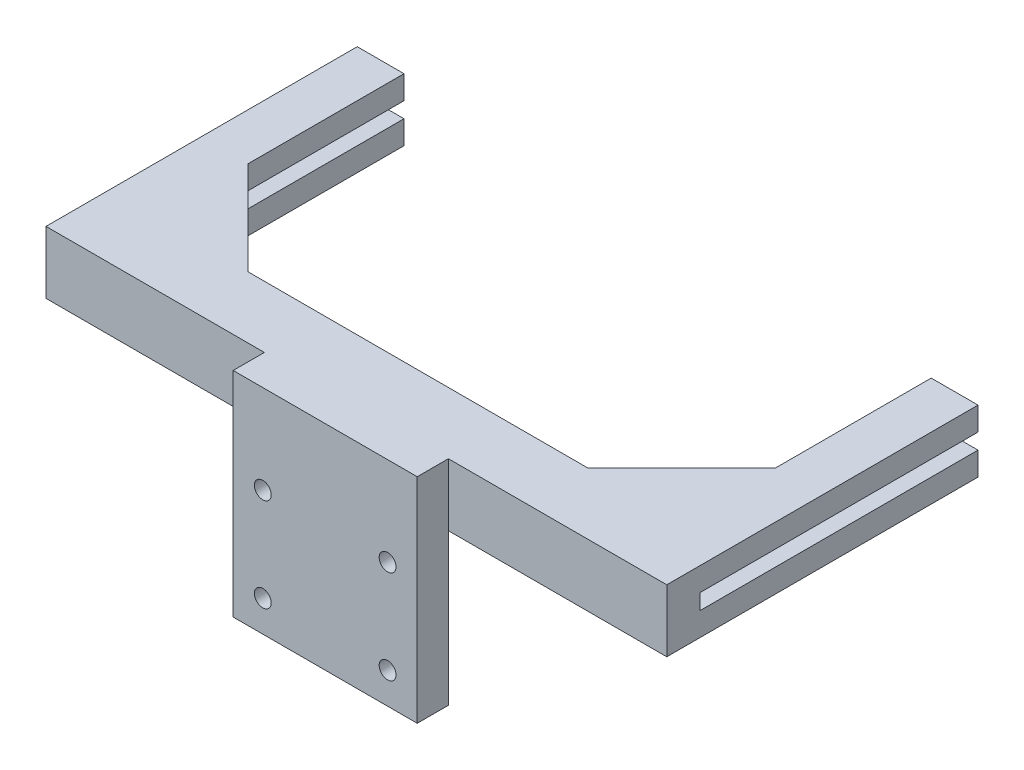
ISO-10303-21;
HEADER;
FILE_DESCRIPTION(('STEP AP214'),'2;1');
FILE_NAME('part.step','',(''),(''),'','','');
FILE_SCHEMA(('AUTOMOTIVE_DESIGN { 1 0 10303 214 1 1 1 1 }'));
ENDSEC;
DATA;
#1=APPLICATION_CONTEXT('core data for automotive mechanical design processes');
#2=APPLICATION_PROTOCOL_DEFINITION('international standard','automotive_design',2000,#1);
#3=PRODUCT_CONTEXT('',#1,'mechanical');
#4=PRODUCT('Part','Part','',(#3));
#5=PRODUCT_RELATED_PRODUCT_CATEGORY('part','',(#4));
#6=PRODUCT_DEFINITION_FORMATION('','',#4);
#7=PRODUCT_DEFINITION_CONTEXT('part definition',#1,'design');
#8=PRODUCT_DEFINITION('design','',#6,#7);
#9=PRODUCT_DEFINITION_SHAPE('','',#8);
#10=(LENGTH_UNIT() NAMED_UNIT(*) SI_UNIT(.MILLI.,.METRE.));
#11=(NAMED_UNIT(*) PLANE_ANGLE_UNIT() SI_UNIT($,.RADIAN.));
#12=(NAMED_UNIT(*) SI_UNIT($,.STERADIAN.) SOLID_ANGLE_UNIT());
#13=UNCERTAINTY_MEASURE_WITH_UNIT(LENGTH_MEASURE(1.E-05),#10,'distance_accuracy_value','');
#14=(GEOMETRIC_REPRESENTATION_CONTEXT(3) GLOBAL_UNCERTAINTY_ASSIGNED_CONTEXT((#13)) GLOBAL_UNIT_ASSIGNED_CONTEXT((#10,
#11,#12)) REPRESENTATION_CONTEXT('',''));
#15=CARTESIAN_POINT('',(0.,0.,0.));
#16=DIRECTION('',(0.,0.,1.));
#17=DIRECTION('',(1.,0.,0.));
#18=AXIS2_PLACEMENT_3D('',#15,#16,#17);
#19=CARTESIAN_POINT('',(0.,0.,-19.7701394823665));
#20=DIRECTION('',(0.,0.,1.));
#21=DIRECTION('',(1.,0.,0.));
#22=AXIS2_PLACEMENT_3D('',#19,#20,#21);
#23=PLANE('',#22);
#24=DIRECTION('',(0.,1.,0.));
#25=VECTOR('',#24,1.);
#26=CARTESIAN_POINT('',(-54.5,-18.9650318029146,-19.7701394823665));
#27=LINE('',#26,#25);
#28=CARTESIAN_POINT('',(-54.5,23.4613750682783,-19.7701394823665));
#29=VERTEX_POINT('',#28);
#30=CARTESIAN_POINT('',(-54.5,30.9613750682782,-19.7701394823665));
#31=VERTEX_POINT('',#30);
#32=EDGE_CURVE('E371',#29,#31,#27,.T.);
#33=ORIENTED_EDGE('',*,*,#32,.T.);
#34=DIRECTION('',(1.,0.,0.));
#35=VECTOR('',#34,1.);
#36=CARTESIAN_POINT('',(0.,30.9613750682782,-19.7701394823665));
#37=LINE('',#36,#35);
#38=CARTESIAN_POINT('',(54.5,30.9613750682783,-19.7701394823665));
#39=VERTEX_POINT('',#38);
#40=EDGE_CURVE('E288',#31,#39,#37,.T.);
#41=ORIENTED_EDGE('',*,*,#40,.T.);
#42=DIRECTION('',(0.,1.,0.));
#43=VECTOR('',#42,1.);
#44=CARTESIAN_POINT('',(54.5,-18.9650318029146,-19.7701394823665));
#45=LINE('',#44,#43);
#46=CARTESIAN_POINT('',(54.5,23.4613750682782,-19.7701394823665));
#47=VERTEX_POINT('',#46);
#48=EDGE_CURVE('E349',#47,#39,#45,.T.);
#49=ORIENTED_EDGE('',*,*,#48,.F.);
#50=DIRECTION('',(-1.,0.,0.));
#51=VECTOR('',#50,1.);
#52=CARTESIAN_POINT('',(-29.5,23.4613750682783,-19.7701394823665));
#53=LINE('',#52,#51);
#54=CARTESIAN_POINT('',(10.,23.4613750682783,-19.7701394823665));
#55=VERTEX_POINT('',#54);
#56=EDGE_CURVE('E442',#47,#55,#53,.T.);
#57=ORIENTED_EDGE('',*,*,#56,.T.);
#58=DIRECTION('',(1.,0.,0.));
#59=VECTOR('',#58,1.);
#60=CARTESIAN_POINT('',(5.,23.4613750682783,-19.7701394823665));
#61=LINE('',#60,#59);
#62=CARTESIAN_POINT('',(5.,23.4613750682783,-19.7701394823665));
#63=VERTEX_POINT('',#62);
#64=EDGE_CURVE('E340',#63,#55,#61,.T.);
#65=ORIENTED_EDGE('',*,*,#64,.F.);
#66=CARTESIAN_POINT('',(-5.,23.4613750682783,-19.7701394823665));
#67=VERTEX_POINT('',#66);
#68=EDGE_CURVE('E446',#63,#67,#53,.T.);
#69=ORIENTED_EDGE('',*,*,#68,.T.);
#70=DIRECTION('',(-1.,0.,0.));
#71=VECTOR('',#70,1.);
#72=CARTESIAN_POINT('',(-5.,23.4613750682783,-19.7701394823665));
#73=LINE('',#72,#71);
#74=CARTESIAN_POINT('',(-10.,23.4613750682783,-19.7701394823665));
#75=VERTEX_POINT('',#74);
#76=EDGE_CURVE('E313',#67,#75,#73,.T.);
#77=ORIENTED_EDGE('',*,*,#76,.T.);
#78=EDGE_CURVE('E447',#75,#29,#53,.T.);
#79=ORIENTED_EDGE('',*,*,#78,.T.);
#80=EDGE_LOOP('',(#33,#41,#49,#57,#65,#69,#77,#79));
#81=FACE_BOUND('',#80,.T.);
#82=ADVANCED_FACE('F40',(#81),#23,.F.);
#83=CARTESIAN_POINT('',(84.5,23.4613750682782,-99.7701394823665));
#84=DIRECTION('',(-1.,0.,0.));
#85=DIRECTION('',(0.,0.,1.));
#86=AXIS2_PLACEMENT_3D('',#83,#84,#85);
#87=PLANE('',#86);
#88=DIRECTION('',(0.,0.,1.));
#89=VECTOR('',#88,1.);
#90=CARTESIAN_POINT('',(84.5,30.9613750682783,-99.7701394823665));
#91=LINE('',#90,#89);
#92=CARTESIAN_POINT('',(84.5,30.9613750682783,-99.7701394823665));
#93=VERTEX_POINT('',#92);
#94=CARTESIAN_POINT('',(84.5,30.9613750682783,-49.7701394823665));
#95=VERTEX_POINT('',#94);
#96=EDGE_CURVE('E286',#93,#95,#91,.T.);
#97=ORIENTED_EDGE('',*,*,#96,.F.);
#98=DIRECTION('',(0.,-1.,0.));
#99=VECTOR('',#98,1.);
#100=CARTESIAN_POINT('',(84.5,23.4613750682782,-99.7701394823665));
#101=LINE('',#100,#99);
#102=CARTESIAN_POINT('',(84.5,23.4613750682782,-99.7701394823665));
#103=VERTEX_POINT('',#102);
#104=EDGE_CURVE('E363',#93,#103,#101,.T.);
#105=ORIENTED_EDGE('',*,*,#104,.T.);
#106=DIRECTION('',(0.,0.,1.));
#107=VECTOR('',#106,1.);
#108=CARTESIAN_POINT('',(84.5,23.4613750682782,-99.7701394823665));
#109=LINE('',#108,#107);
#110=CARTESIAN_POINT('',(84.5,23.4613750682782,-49.7701394823665));
#111=VERTEX_POINT('',#110);
#112=EDGE_CURVE('E387',#103,#111,#109,.T.);
#113=ORIENTED_EDGE('',*,*,#112,.T.);
#114=DIRECTION('',(0.,1.,0.));
#115=VECTOR('',#114,1.);
#116=CARTESIAN_POINT('',(84.5,-18.9650318029146,-49.7701394823665));
#117=LINE('',#116,#115);
#118=EDGE_CURVE('E354',#111,#95,#117,.T.);
#119=ORIENTED_EDGE('',*,*,#118,.T.);
#120=EDGE_LOOP('',(#97,#105,#113,#119));
#121=FACE_BOUND('',#120,.T.);
#122=ADVANCED_FACE('F548',(#121),#87,.T.);
#123=CARTESIAN_POINT('',(-84.5,23.4613750682782,-99.7701394823665));
#124=DIRECTION('',(-1.,0.,0.));
#125=DIRECTION('',(0.,0.,1.));
#126=AXIS2_PLACEMENT_3D('',#123,#124,#125);
#127=PLANE('',#126);
#128=DIRECTION('',(0.,-1.,0.));
#129=VECTOR('',#128,1.);
#130=CARTESIAN_POINT('',(-84.5,23.4613750682782,-99.7701394823665));
#131=LINE('',#130,#129);
#132=CARTESIAN_POINT('',(-84.5,30.9613750682782,-99.7701394823665));
#133=VERTEX_POINT('',#132);
#134=CARTESIAN_POINT('',(-84.5,23.4613750682782,-99.7701394823665));
#135=VERTEX_POINT('',#134);
#136=EDGE_CURVE('E408',#133,#135,#131,.T.);
#137=ORIENTED_EDGE('',*,*,#136,.F.);
#138=DIRECTION('',(0.,0.,1.));
#139=VECTOR('',#138,1.);
#140=CARTESIAN_POINT('',(-84.5,30.9613750682782,-99.7701394823665));
#141=LINE('',#140,#139);
#142=CARTESIAN_POINT('',(-84.5,30.9613750682782,-49.7701394823665));
#143=VERTEX_POINT('',#142);
#144=EDGE_CURVE('E296',#133,#143,#141,.T.);
#145=ORIENTED_EDGE('',*,*,#144,.T.);
#146=DIRECTION('',(0.,1.,0.));
#147=VECTOR('',#146,1.);
#148=CARTESIAN_POINT('',(-84.5,-18.9650318029146,-49.7701394823665));
#149=LINE('',#148,#147);
#150=CARTESIAN_POINT('',(-84.5,23.4613750682783,-49.7701394823665));
#151=VERTEX_POINT('',#150);
#152=EDGE_CURVE('E364',#151,#143,#149,.T.);
#153=ORIENTED_EDGE('',*,*,#152,.F.);
#154=DIRECTION('',(0.,0.,1.));
#155=VECTOR('',#154,1.);
#156=CARTESIAN_POINT('',(-84.5,23.4613750682782,-99.7701394823665));
#157=LINE('',#156,#155);
#158=EDGE_CURVE('E423',#135,#151,#157,.T.);
#159=ORIENTED_EDGE('',*,*,#158,.F.);
#160=EDGE_LOOP('',(#137,#145,#153,#159));
#161=FACE_BOUND('',#160,.T.);
#162=ADVANCED_FACE('F607',(#161),#127,.F.);
#163=CARTESIAN_POINT('',(0.,0.,-99.7701394823665));
#164=DIRECTION('',(0.,0.,1.));
#165=DIRECTION('',(1.,0.,0.));
#166=AXIS2_PLACEMENT_3D('',#163,#164,#165);
#167=PLANE('',#166);
#168=DIRECTION('',(0.,1.,0.));
#169=VECTOR('',#168,1.);
#170=CARTESIAN_POINT('',(-99.5,43.4613750682783,-99.7701394823665));
#171=LINE('',#170,#169);
#172=CARTESIAN_POINT('',(-99.5,23.4613750682783,-99.7701394823665));
#173=VERTEX_POINT('',#172);
#174=CARTESIAN_POINT('',(-99.5,30.9613750682782,-99.7701394823665));
#175=VERTEX_POINT('',#174);
#176=EDGE_CURVE('E415',#173,#175,#171,.T.);
#177=ORIENTED_EDGE('',*,*,#176,.T.);
#178=DIRECTION('',(1.,0.,0.));
#179=VECTOR('',#178,1.);
#180=CARTESIAN_POINT('',(0.,30.9613750682782,-99.7701394823665));
#181=LINE('',#180,#179);
#182=EDGE_CURVE('E299',#175,#133,#181,.T.);
#183=ORIENTED_EDGE('',*,*,#182,.T.);
#184=ORIENTED_EDGE('',*,*,#136,.T.);
#185=DIRECTION('',(-1.,0.,0.));
#186=VECTOR('',#185,1.);
#187=CARTESIAN_POINT('',(-99.5,23.4613750682783,-99.7701394823665));
#188=LINE('',#187,#186);
#189=EDGE_CURVE('E412',#135,#173,#188,.T.);
#190=ORIENTED_EDGE('',*,*,#189,.T.);
#191=EDGE_LOOP('',(#177,#183,#184,#190));
#192=FACE_BOUND('',#191,.T.);
#193=ADVANCED_FACE('F714',(#192),#167,.F.);
#194=CARTESIAN_POINT('',(0.,0.,-99.7701394823665));
#195=DIRECTION('',(0.,0.,1.));
#196=DIRECTION('',(-1.,0.,0.));
#197=AXIS2_PLACEMENT_3D('',#194,#195,#196);
#198=PLANE('',#197);
#199=ORIENTED_EDGE('',*,*,#104,.F.);
#200=DIRECTION('',(1.,0.,0.));
#201=VECTOR('',#200,1.);
#202=CARTESIAN_POINT('',(0.,30.9613750682782,-99.7701394823665));
#203=LINE('',#202,#201);
#204=CARTESIAN_POINT('',(99.5,30.9613750682783,-99.7701394823665));
#205=VERTEX_POINT('',#204);
#206=EDGE_CURVE('E293',#93,#205,#203,.T.);
#207=ORIENTED_EDGE('',*,*,#206,.T.);
#208=DIRECTION('',(0.,1.,0.));
#209=VECTOR('',#208,1.);
#210=CARTESIAN_POINT('',(99.5,43.4613750682783,-99.7701394823665));
#211=LINE('',#210,#209);
#212=CARTESIAN_POINT('',(99.5,23.4613750682783,-99.7701394823665));
#213=VERTEX_POINT('',#212);
#214=EDGE_CURVE('E381',#213,#205,#211,.T.);
#215=ORIENTED_EDGE('',*,*,#214,.F.);
#216=DIRECTION('',(1.,0.,0.));
#217=VECTOR('',#216,1.);
#218=CARTESIAN_POINT('',(99.5,23.4613750682783,-99.7701394823665));
#219=LINE('',#218,#217);
#220=EDGE_CURVE('E384',#103,#213,#219,.T.);
#221=ORIENTED_EDGE('',*,*,#220,.F.);
#222=EDGE_LOOP('',(#199,#207,#215,#221));
#223=FACE_BOUND('',#222,.T.);
#224=ADVANCED_FACE('F537',(#223),#198,.F.);
#225=CARTESIAN_POINT('',(-54.5,-18.9650318029146,-19.7701394823665));
#226=DIRECTION('',(0.707106781186547,0.,-0.707106781186548));
#227=DIRECTION('',(-0.707106781186548,0.,-0.707106781186547));
#228=AXIS2_PLACEMENT_3D('',#225,#226,#227);
#229=PLANE('',#228);
#230=DIRECTION('',(-0.707106781186548,0.,-0.707106781186547));
#231=VECTOR('',#230,1.);
#232=CARTESIAN_POINT('',(-54.5,30.9613750682782,-19.7701394823665));
#233=LINE('',#232,#231);
#234=EDGE_CURVE('E291',#31,#143,#233,.T.);
#235=ORIENTED_EDGE('',*,*,#234,.F.);
#236=ORIENTED_EDGE('',*,*,#32,.F.);
#237=DIRECTION('',(0.707106781186548,0.,0.707106781186547));
#238=VECTOR('',#237,1.);
#239=CARTESIAN_POINT('',(-54.5,23.4613750682783,-19.7701394823665));
#240=LINE('',#239,#238);
#241=EDGE_CURVE('E360',#151,#29,#240,.T.);
#242=ORIENTED_EDGE('',*,*,#241,.F.);
#243=ORIENTED_EDGE('',*,*,#152,.T.);
#244=EDGE_LOOP('',(#235,#236,#242,#243));
#245=FACE_BOUND('',#244,.T.);
#246=ADVANCED_FACE('F634',(#245),#229,.T.);
#247=CARTESIAN_POINT('',(54.5,-18.9650318029146,-19.7701394823665));
#248=DIRECTION('',(0.707106781186547,0.,0.707106781186548));
#249=DIRECTION('',(0.707106781186548,0.,-0.707106781186547));
#250=AXIS2_PLACEMENT_3D('',#247,#248,#249);
#251=PLANE('',#250);
#252=ORIENTED_EDGE('',*,*,#48,.T.);
#253=DIRECTION('',(0.707106781186548,0.,-0.707106781186547));
#254=VECTOR('',#253,1.);
#255=CARTESIAN_POINT('',(54.5,30.9613750682783,-19.7701394823665));
#256=LINE('',#255,#254);
#257=EDGE_CURVE('E11',#39,#95,#256,.T.);
#258=ORIENTED_EDGE('',*,*,#257,.T.);
#259=ORIENTED_EDGE('',*,*,#118,.F.);
#260=DIRECTION('',(-0.707106781186548,0.,0.707106781186547));
#261=VECTOR('',#260,1.);
#262=CARTESIAN_POINT('',(54.5,23.4613750682782,-19.7701394823665));
#263=LINE('',#262,#261);
#264=EDGE_CURVE('E352',#111,#47,#263,.T.);
#265=ORIENTED_EDGE('',*,*,#264,.T.);
#266=EDGE_LOOP('',(#252,#258,#259,#265));
#267=FACE_BOUND('',#266,.T.);
#268=ADVANCED_FACE('F550',(#267),#251,.F.);
#269=CARTESIAN_POINT('',(0.,0.,0.));
#270=DIRECTION('',(0.,0.,-1.));
#271=DIRECTION('',(-1.,0.,0.));
#272=AXIS2_PLACEMENT_3D('',#269,#270,#271);
#273=PLANE('',#272);
#274=CARTESIAN_POINT('',(-20.,-15.,0.));
#275=DIRECTION('',(0.,0.,-1.));
#276=DIRECTION('',(-1.,0.,0.));
#277=AXIS2_PLACEMENT_3D('',#274,#275,#276);
#278=CIRCLE('',#277,2.7);
#279=CARTESIAN_POINT('',(-22.7,-15.,0.));
#280=VERTEX_POINT('',#279);
#281=EDGE_CURVE('E470',#280,#280,#278,.T.);
#282=ORIENTED_EDGE('',*,*,#281,.F.);
#283=EDGE_LOOP('',(#282));
#284=FACE_BOUND('',#283,.T.);
#285=CARTESIAN_POINT('',(-20.,15.,0.));
#286=DIRECTION('',(0.,0.,-1.));
#287=DIRECTION('',(-1.,0.,0.));
#288=AXIS2_PLACEMENT_3D('',#285,#286,#287);
#289=CIRCLE('',#288,2.7);
#290=CARTESIAN_POINT('',(-22.7,15.,0.));
#291=VERTEX_POINT('',#290);
#292=EDGE_CURVE('E482',#291,#291,#289,.F.);
#293=ORIENTED_EDGE('',*,*,#292,.T.);
#294=EDGE_LOOP('',(#293));
#295=FACE_BOUND('',#294,.T.);
#296=DIRECTION('',(-1.,0.,0.));
#297=VECTOR('',#296,1.);
#298=CARTESIAN_POINT('',(-29.5,23.4613750682783,0.));
#299=LINE('',#298,#297);
#300=CARTESIAN_POINT('',(-10.,23.4613750682783,0.));
#301=VERTEX_POINT('',#300);
#302=CARTESIAN_POINT('',(-29.5,23.4613750682783,0.));
#303=VERTEX_POINT('',#302);
#304=EDGE_CURVE('E441',#301,#303,#299,.T.);
#305=ORIENTED_EDGE('',*,*,#304,.F.);
#306=DIRECTION('',(0.,-1.,0.));
#307=VECTOR('',#306,1.);
#308=CARTESIAN_POINT('',(-10.,23.4613750682783,0.));
#309=LINE('',#308,#307);
#310=CARTESIAN_POINT('',(-10.,-25.,0.));
#311=VERTEX_POINT('',#310);
#312=EDGE_CURVE('E302',#301,#311,#309,.T.);
#313=ORIENTED_EDGE('',*,*,#312,.T.);
#314=DIRECTION('',(1.,0.,0.));
#315=VECTOR('',#314,1.);
#316=CARTESIAN_POINT('',(-29.5,-25.,0.));
#317=LINE('',#316,#315);
#318=CARTESIAN_POINT('',(-29.5,-25.,0.));
#319=VERTEX_POINT('',#318);
#320=EDGE_CURVE('E489',#319,#311,#317,.T.);
#321=ORIENTED_EDGE('',*,*,#320,.F.);
#322=DIRECTION('',(0.,-1.,0.));
#323=VECTOR('',#322,1.);
#324=CARTESIAN_POINT('',(-29.5,-25.,0.));
#325=LINE('',#324,#323);
#326=EDGE_CURVE('E496',#303,#319,#325,.T.);
#327=ORIENTED_EDGE('',*,*,#326,.F.);
#328=EDGE_LOOP('',(#305,#313,#321,#327));
#329=FACE_BOUND('',#328,.T.);
#330=ADVANCED_FACE('F584',(#284,#295,#329),#273,.T.);
#331=CARTESIAN_POINT('',(-29.5,23.4613750682783,-19.7701394823665));
#332=DIRECTION('',(0.,1.,0.));
#333=DIRECTION('',(-1.,0.,0.));
#334=AXIS2_PLACEMENT_3D('',#331,#332,#333);
#335=PLANE('',#334);
#336=DIRECTION('',(0.,0.,1.));
#337=VECTOR('',#336,1.);
#338=CARTESIAN_POINT('',(-10.,23.4613750682783,-19.7701394823665));
#339=LINE('',#338,#337);
#340=EDGE_CURVE('E315',#75,#301,#339,.T.);
#341=ORIENTED_EDGE('',*,*,#340,.T.);
#342=ORIENTED_EDGE('',*,*,#304,.T.);
#343=DIRECTION('',(1.,0.,0.));
#344=VECTOR('',#343,1.);
#345=CARTESIAN_POINT('',(-99.5,23.4613750682783,0.));
#346=LINE('',#345,#344);
#347=CARTESIAN_POINT('',(-99.5,23.4613750682783,0.));
#348=VERTEX_POINT('',#347);
#349=EDGE_CURVE('E438',#348,#303,#346,.T.);
#350=ORIENTED_EDGE('',*,*,#349,.F.);
#351=DIRECTION('',(0.,0.,1.));
#352=VECTOR('',#351,1.);
#353=CARTESIAN_POINT('',(-99.5,23.4613750682783,0.));
#354=LINE('',#353,#352);
#355=EDGE_CURVE('E427',#173,#348,#354,.T.);
#356=ORIENTED_EDGE('',*,*,#355,.F.);
#357=ORIENTED_EDGE('',*,*,#189,.F.);
#358=ORIENTED_EDGE('',*,*,#158,.T.);
#359=ORIENTED_EDGE('',*,*,#241,.T.);
#360=ORIENTED_EDGE('',*,*,#78,.F.);
#361=EDGE_LOOP('',(#341,#342,#350,#356,#357,#358,#359,#360));
#362=FACE_BOUND('',#361,.T.);
#363=ADVANCED_FACE('F579',(#362),#335,.F.);
#364=CARTESIAN_POINT('',(20.,15.,0.));
#365=DIRECTION('',(0.,0.,-1.));
#366=DIRECTION('',(-1.,0.,0.));
#367=AXIS2_PLACEMENT_3D('',#364,#365,#366);
#368=CIRCLE('',#367,2.7);
#369=CARTESIAN_POINT('',(17.3,15.,0.));
#370=VERTEX_POINT('',#369);
#371=EDGE_CURVE('E476',#370,#370,#368,.T.);
#372=ORIENTED_EDGE('',*,*,#371,.F.);
#373=EDGE_LOOP('',(#372));
#374=FACE_BOUND('',#373,.T.);
#375=CARTESIAN_POINT('',(20.,-15.,0.));
#376=DIRECTION('',(0.,0.,-1.));
#377=DIRECTION('',(-1.,0.,0.));
#378=AXIS2_PLACEMENT_3D('',#375,#376,#377);
#379=CIRCLE('',#378,2.7);
#380=CARTESIAN_POINT('',(17.3,-15.,0.));
#381=VERTEX_POINT('',#380);
#382=EDGE_CURVE('E464',#381,#381,#379,.F.);
#383=ORIENTED_EDGE('',*,*,#382,.T.);
#384=EDGE_LOOP('',(#383));
#385=FACE_BOUND('',#384,.T.);
#386=CARTESIAN_POINT('',(10.,-25.,0.));
#387=VERTEX_POINT('',#386);
#388=CARTESIAN_POINT('',(29.5,-25.,0.));
#389=VERTEX_POINT('',#388);
#390=EDGE_CURVE('E498',#387,#389,#317,.T.);
#391=ORIENTED_EDGE('',*,*,#390,.F.);
#392=DIRECTION('',(0.,-1.,0.));
#393=VECTOR('',#392,1.);
#394=CARTESIAN_POINT('',(10.,23.4613750682783,0.));
#395=LINE('',#394,#393);
#396=CARTESIAN_POINT('',(10.,23.4613750682783,0.));
#397=VERTEX_POINT('',#396);
#398=EDGE_CURVE('E322',#397,#387,#395,.T.);
#399=ORIENTED_EDGE('',*,*,#398,.F.);
#400=CARTESIAN_POINT('',(29.5,23.4613750682783,0.));
#401=VERTEX_POINT('',#400);
#402=EDGE_CURVE('E451',#401,#397,#299,.T.);
#403=ORIENTED_EDGE('',*,*,#402,.F.);
#404=DIRECTION('',(0.,1.,0.));
#405=VECTOR('',#404,1.);
#406=CARTESIAN_POINT('',(29.5,-25.,0.));
#407=LINE('',#406,#405);
#408=EDGE_CURVE('E485',#389,#401,#407,.T.);
#409=ORIENTED_EDGE('',*,*,#408,.F.);
#410=EDGE_LOOP('',(#391,#399,#403,#409));
#411=FACE_BOUND('',#410,.T.);
#412=ADVANCED_FACE('F617',(#374,#385,#411),#273,.T.);
#413=DIRECTION('',(0.,0.,1.));
#414=VECTOR('',#413,1.);
#415=CARTESIAN_POINT('',(10.,23.4613750682783,-19.7701394823665));
#416=LINE('',#415,#414);
#417=EDGE_CURVE('E327',#55,#397,#416,.T.);
#418=ORIENTED_EDGE('',*,*,#417,.F.);
#419=ORIENTED_EDGE('',*,*,#56,.F.);
#420=ORIENTED_EDGE('',*,*,#264,.F.);
#421=ORIENTED_EDGE('',*,*,#112,.F.);
#422=ORIENTED_EDGE('',*,*,#220,.T.);
#423=DIRECTION('',(0.,0.,1.));
#424=VECTOR('',#423,1.);
#425=CARTESIAN_POINT('',(99.5,23.4613750682783,0.));
#426=LINE('',#425,#424);
#427=CARTESIAN_POINT('',(99.5,23.4613750682783,0.));
#428=VERTEX_POINT('',#427);
#429=EDGE_CURVE('E399',#213,#428,#426,.T.);
#430=ORIENTED_EDGE('',*,*,#429,.T.);
#431=DIRECTION('',(-1.,0.,0.));
#432=VECTOR('',#431,1.);
#433=CARTESIAN_POINT('',(99.5,23.4613750682783,0.));
#434=LINE('',#433,#432);
#435=EDGE_CURVE('E402',#428,#401,#434,.T.);
#436=ORIENTED_EDGE('',*,*,#435,.T.);
#437=ORIENTED_EDGE('',*,*,#402,.T.);
#438=EDGE_LOOP('',(#418,#419,#420,#421,#422,#430,#436,#437));
#439=FACE_BOUND('',#438,.T.);
#440=ADVANCED_FACE('F541',(#439),#335,.F.);
#441=CARTESIAN_POINT('',(54.5,35.9613750682783,-19.7701394823665));
#442=VERTEX_POINT('',#441);
#443=CARTESIAN_POINT('',(54.5,43.4613750682783,-19.7701394823665));
#444=VERTEX_POINT('',#443);
#445=EDGE_CURVE('E353',#442,#444,#45,.T.);
#446=ORIENTED_EDGE('',*,*,#445,.F.);
#447=DIRECTION('',(-1.,0.,0.));
#448=VECTOR('',#447,1.);
#449=CARTESIAN_POINT('',(0.,35.9613750682783,-19.7701394823665));
#450=LINE('',#449,#448);
#451=CARTESIAN_POINT('',(-54.5,35.9613750682783,-19.7701394823665));
#452=VERTEX_POINT('',#451);
#453=EDGE_CURVE('E55',#442,#452,#450,.T.);
#454=ORIENTED_EDGE('',*,*,#453,.T.);
#455=CARTESIAN_POINT('',(-54.5,43.4613750682783,-19.7701394823665));
#456=VERTEX_POINT('',#455);
#457=EDGE_CURVE('E367',#452,#456,#27,.T.);
#458=ORIENTED_EDGE('',*,*,#457,.T.);
#459=DIRECTION('',(1.,0.,0.));
#460=VECTOR('',#459,1.);
#461=CARTESIAN_POINT('',(29.5,43.4613750682783,-19.7701394823665));
#462=LINE('',#461,#460);
#463=EDGE_CURVE('E445',#456,#444,#462,.T.);
#464=ORIENTED_EDGE('',*,*,#463,.T.);
#465=EDGE_LOOP('',(#446,#454,#458,#464));
#466=FACE_BOUND('',#465,.T.);
#467=ADVANCED_FACE('F511',(#466),#23,.F.);
#468=DIRECTION('',(0.,0.,-1.));
#469=VECTOR('',#468,1.);
#470=CARTESIAN_POINT('',(84.5,35.9613750682783,-99.7701394823665));
#471=LINE('',#470,#469);
#472=CARTESIAN_POINT('',(84.5,35.9613750682783,-49.7701394823665));
#473=VERTEX_POINT('',#472);
#474=CARTESIAN_POINT('',(84.5,35.9613750682783,-99.7701394823665));
#475=VERTEX_POINT('',#474);
#476=EDGE_CURVE('E272',#473,#475,#471,.T.);
#477=ORIENTED_EDGE('',*,*,#476,.F.);
#478=CARTESIAN_POINT('',(84.5,43.4613750682783,-49.7701394823665));
#479=VERTEX_POINT('',#478);
#480=EDGE_CURVE('E348',#473,#479,#117,.T.);
#481=ORIENTED_EDGE('',*,*,#480,.T.);
#482=DIRECTION('',(0.,0.,1.));
#483=VECTOR('',#482,1.);
#484=CARTESIAN_POINT('',(84.5,43.4613750682783,-99.7701394823665));
#485=LINE('',#484,#483);
#486=CARTESIAN_POINT('',(84.5,43.4613750682783,-99.7701394823665));
#487=VERTEX_POINT('',#486);
#488=EDGE_CURVE('E389',#487,#479,#485,.T.);
#489=ORIENTED_EDGE('',*,*,#488,.F.);
#490=EDGE_CURVE('E374',#487,#475,#101,.T.);
#491=ORIENTED_EDGE('',*,*,#490,.T.);
#492=EDGE_LOOP('',(#477,#481,#489,#491));
#493=FACE_BOUND('',#492,.T.);
#494=ADVANCED_FACE('F521',(#493),#87,.T.);
#495=CARTESIAN_POINT('',(-29.5,-25.,10.));
#496=DIRECTION('',(1.,0.,0.));
#497=DIRECTION('',(0.,0.,-1.));
#498=AXIS2_PLACEMENT_3D('',#495,#496,#497);
#499=PLANE('',#498);
#500=DIRECTION('',(0.,1.,0.));
#501=VECTOR('',#500,1.);
#502=CARTESIAN_POINT('',(-29.5,43.4613750682783,0.));
#503=LINE('',#502,#501);
#504=CARTESIAN_POINT('',(-29.5,43.4613750682783,0.));
#505=VERTEX_POINT('',#504);
#506=EDGE_CURVE('E426',#303,#505,#503,.T.);
#507=ORIENTED_EDGE('',*,*,#506,.F.);
#508=ORIENTED_EDGE('',*,*,#326,.T.);
#509=DIRECTION('',(0.,0.,-1.));
#510=VECTOR('',#509,1.);
#511=CARTESIAN_POINT('',(-29.5,-25.,10.));
#512=LINE('',#511,#510);
#513=CARTESIAN_POINT('',(-29.5,-25.,10.));
#514=VERTEX_POINT('',#513);
#515=EDGE_CURVE('E503',#514,#319,#512,.T.);
#516=ORIENTED_EDGE('',*,*,#515,.F.);
#517=DIRECTION('',(0.,-1.,0.));
#518=VECTOR('',#517,1.);
#519=CARTESIAN_POINT('',(-29.5,-25.,10.));
#520=LINE('',#519,#518);
#521=CARTESIAN_POINT('',(-29.5,43.4613750682783,10.));
#522=VERTEX_POINT('',#521);
#523=EDGE_CURVE('E488',#522,#514,#520,.T.);
#524=ORIENTED_EDGE('',*,*,#523,.F.);
#525=DIRECTION('',(0.,0.,1.));
#526=VECTOR('',#525,1.);
#527=CARTESIAN_POINT('',(-29.5,43.4613750682783,10.));
#528=LINE('',#527,#526);
#529=EDGE_CURVE('E450',#505,#522,#528,.T.);
#530=ORIENTED_EDGE('',*,*,#529,.F.);
#531=EDGE_LOOP('',(#507,#508,#516,#524,#530));
#532=FACE_BOUND('',#531,.T.);
#533=ADVANCED_FACE('F616',(#532),#499,.F.);
#534=CARTESIAN_POINT('',(29.5,-25.,10.));
#535=DIRECTION('',(-1.,0.,0.));
#536=DIRECTION('',(0.,0.,1.));
#537=AXIS2_PLACEMENT_3D('',#534,#535,#536);
#538=PLANE('',#537);
#539=ORIENTED_EDGE('',*,*,#408,.T.);
#540=DIRECTION('',(0.,1.,0.));
#541=VECTOR('',#540,1.);
#542=CARTESIAN_POINT('',(29.5,43.4613750682783,0.));
#543=LINE('',#542,#541);
#544=CARTESIAN_POINT('',(29.5,43.4613750682783,0.));
#545=VERTEX_POINT('',#544);
#546=EDGE_CURVE('E392',#401,#545,#543,.T.);
#547=ORIENTED_EDGE('',*,*,#546,.T.);
#548=DIRECTION('',(0.,0.,-1.));
#549=VECTOR('',#548,1.);
#550=CARTESIAN_POINT('',(29.5,43.4613750682783,0.));
#551=LINE('',#550,#549);
#552=CARTESIAN_POINT('',(29.5,43.4613750682783,10.));
#553=VERTEX_POINT('',#552);
#554=EDGE_CURVE('E458',#553,#545,#551,.T.);
#555=ORIENTED_EDGE('',*,*,#554,.F.);
#556=DIRECTION('',(0.,1.,0.));
#557=VECTOR('',#556,1.);
#558=CARTESIAN_POINT('',(29.5,-25.,10.));
#559=LINE('',#558,#557);
#560=CARTESIAN_POINT('',(29.5,-25.,10.));
#561=VERTEX_POINT('',#560);
#562=EDGE_CURVE('E486',#561,#553,#559,.T.);
#563=ORIENTED_EDGE('',*,*,#562,.F.);
#564=DIRECTION('',(0.,0.,-1.));
#565=VECTOR('',#564,1.);
#566=CARTESIAN_POINT('',(29.5,-25.,10.));
#567=LINE('',#566,#565);
#568=EDGE_CURVE('E493',#561,#389,#567,.T.);
#569=ORIENTED_EDGE('',*,*,#568,.T.);
#570=EDGE_LOOP('',(#539,#547,#555,#563,#569));
#571=FACE_BOUND('',#570,.T.);
#572=ADVANCED_FACE('F42',(#571),#538,.F.);
#573=CARTESIAN_POINT('',(-29.5,-25.,10.));
#574=DIRECTION('',(0.,1.,0.));
#575=DIRECTION('',(0.,0.,1.));
#576=AXIS2_PLACEMENT_3D('',#573,#574,#575);
#577=PLANE('',#576);
#578=ORIENTED_EDGE('',*,*,#320,.T.);
#579=DIRECTION('',(-1.,0.,0.));
#580=VECTOR('',#579,1.);
#581=CARTESIAN_POINT('',(-5.,-25.,0.));
#582=LINE('',#581,#580);
#583=CARTESIAN_POINT('',(-5.,-25.,0.));
#584=VERTEX_POINT('',#583);
#585=EDGE_CURVE('E319',#584,#311,#582,.T.);
#586=ORIENTED_EDGE('',*,*,#585,.F.);
#587=CARTESIAN_POINT('',(5.,-25.,0.));
#588=VERTEX_POINT('',#587);
#589=EDGE_CURVE('E63',#584,#588,#317,.T.);
#590=ORIENTED_EDGE('',*,*,#589,.T.);
#591=DIRECTION('',(1.,0.,0.));
#592=VECTOR('',#591,1.);
#593=CARTESIAN_POINT('',(5.,-25.,0.));
#594=LINE('',#593,#592);
#595=EDGE_CURVE('E332',#588,#387,#594,.T.);
#596=ORIENTED_EDGE('',*,*,#595,.T.);
#597=ORIENTED_EDGE('',*,*,#390,.T.);
#598=ORIENTED_EDGE('',*,*,#568,.F.);
#599=DIRECTION('',(1.,0.,0.));
#600=VECTOR('',#599,1.);
#601=CARTESIAN_POINT('',(-29.5,-25.,10.));
#602=LINE('',#601,#600);
#603=EDGE_CURVE('E491',#514,#561,#602,.T.);
#604=ORIENTED_EDGE('',*,*,#603,.F.);
#605=ORIENTED_EDGE('',*,*,#515,.T.);
#606=EDGE_LOOP('',(#578,#586,#590,#596,#597,#598,#604,#605));
#607=FACE_BOUND('',#606,.T.);
#608=ADVANCED_FACE('F650',(#607),#577,.F.);
#609=CARTESIAN_POINT('',(0.,0.,10.));
#610=DIRECTION('',(0.,0.,-1.));
#611=DIRECTION('',(-1.,0.,0.));
#612=AXIS2_PLACEMENT_3D('',#609,#610,#611);
#613=PLANE('',#612);
#614=CARTESIAN_POINT('',(20.,-15.,10.));
#615=DIRECTION('',(0.,0.,1.));
#616=DIRECTION('',(-1.,0.,0.));
#617=AXIS2_PLACEMENT_3D('',#614,#615,#616);
#618=CIRCLE('',#617,2.7);
#619=CARTESIAN_POINT('',(17.3,-15.,10.));
#620=VERTEX_POINT('',#619);
#621=EDGE_CURVE('E461',#620,#620,#618,.T.);
#622=ORIENTED_EDGE('',*,*,#621,.F.);
#623=EDGE_LOOP('',(#622));
#624=FACE_BOUND('',#623,.T.);
#625=CARTESIAN_POINT('',(-20.,-15.,10.));
#626=DIRECTION('',(0.,0.,-1.));
#627=DIRECTION('',(1.,0.,0.));
#628=AXIS2_PLACEMENT_3D('',#625,#626,#627);
#629=CIRCLE('',#628,2.7);
#630=CARTESIAN_POINT('',(-17.3,-15.,10.));
#631=VERTEX_POINT('',#630);
#632=EDGE_CURVE('E467',#631,#631,#629,.T.);
#633=ORIENTED_EDGE('',*,*,#632,.T.);
#634=EDGE_LOOP('',(#633));
#635=FACE_BOUND('',#634,.T.);
#636=CARTESIAN_POINT('',(20.,15.,10.));
#637=DIRECTION('',(0.,0.,-1.));
#638=DIRECTION('',(-1.,0.,0.));
#639=AXIS2_PLACEMENT_3D('',#636,#637,#638);
#640=CIRCLE('',#639,2.7);
#641=CARTESIAN_POINT('',(17.3,15.,10.));
#642=VERTEX_POINT('',#641);
#643=EDGE_CURVE('E473',#642,#642,#640,.T.);
#644=ORIENTED_EDGE('',*,*,#643,.T.);
#645=EDGE_LOOP('',(#644));
#646=FACE_BOUND('',#645,.T.);
#647=CARTESIAN_POINT('',(-20.,15.,10.));
#648=DIRECTION('',(0.,0.,1.));
#649=DIRECTION('',(1.,0.,0.));
#650=AXIS2_PLACEMENT_3D('',#647,#648,#649);
#651=CIRCLE('',#650,2.7);
#652=CARTESIAN_POINT('',(-17.3,15.,10.));
#653=VERTEX_POINT('',#652);
#654=EDGE_CURVE('E479',#653,#653,#651,.T.);
#655=ORIENTED_EDGE('',*,*,#654,.F.);
#656=EDGE_LOOP('',(#655));
#657=FACE_BOUND('',#656,.T.);
#658=ORIENTED_EDGE('',*,*,#562,.T.);
#659=DIRECTION('',(1.,0.,0.));
#660=VECTOR('',#659,1.);
#661=CARTESIAN_POINT('',(29.5,43.4613750682783,10.));
#662=LINE('',#661,#660);
#663=EDGE_CURVE('E455',#522,#553,#662,.T.);
#664=ORIENTED_EDGE('',*,*,#663,.F.);
#665=ORIENTED_EDGE('',*,*,#523,.T.);
#666=ORIENTED_EDGE('',*,*,#603,.T.);
#667=EDGE_LOOP('',(#658,#664,#665,#666));
#668=FACE_BOUND('',#667,.T.);
#669=ADVANCED_FACE('F642',(#624,#635,#646,#657,#668),#613,.F.);
#670=DIRECTION('',(0.,-1.,0.));
#671=VECTOR('',#670,1.);
#672=CARTESIAN_POINT('',(-5.,23.4613750682783,0.));
#673=LINE('',#672,#671);
#674=CARTESIAN_POINT('',(-5.,23.4613750682783,0.));
#675=VERTEX_POINT('',#674);
#676=EDGE_CURVE('E303',#675,#584,#673,.T.);
#677=ORIENTED_EDGE('',*,*,#676,.F.);
#678=CARTESIAN_POINT('',(5.,23.4613750682783,0.));
#679=VERTEX_POINT('',#678);
#680=EDGE_CURVE('E453',#679,#675,#299,.T.);
#681=ORIENTED_EDGE('',*,*,#680,.F.);
#682=DIRECTION('',(0.,-1.,0.));
#683=VECTOR('',#682,1.);
#684=CARTESIAN_POINT('',(5.,23.4613750682783,0.));
#685=LINE('',#684,#683);
#686=EDGE_CURVE('E324',#679,#588,#685,.T.);
#687=ORIENTED_EDGE('',*,*,#686,.T.);
#688=ORIENTED_EDGE('',*,*,#589,.F.);
#689=EDGE_LOOP('',(#677,#681,#687,#688));
#690=FACE_BOUND('',#689,.T.);
#691=ADVANCED_FACE('F590',(#690),#273,.T.);
#692=CARTESIAN_POINT('',(-20.,15.,-7.63675323681472));
#693=DIRECTION('',(0.,0.,1.));
#694=DIRECTION('',(1.,0.,0.));
#695=AXIS2_PLACEMENT_3D('',#692,#693,#694);
#696=CYLINDRICAL_SURFACE('',#695,2.7);
#697=ORIENTED_EDGE('',*,*,#654,.T.);
#698=EDGE_LOOP('',(#697));
#699=FACE_BOUND('',#698,.T.);
#700=ORIENTED_EDGE('',*,*,#292,.F.);
#701=EDGE_LOOP('',(#700));
#702=FACE_BOUND('',#701,.T.);
#703=ADVANCED_FACE('F641',(#699,#702),#696,.F.);
#704=CARTESIAN_POINT('',(20.,15.,-7.63675323681472));
#705=DIRECTION('',(0.,0.,1.));
#706=DIRECTION('',(1.,0.,0.));
#707=AXIS2_PLACEMENT_3D('',#704,#705,#706);
#708=CYLINDRICAL_SURFACE('',#707,2.7);
#709=ORIENTED_EDGE('',*,*,#643,.F.);
#710=EDGE_LOOP('',(#709));
#711=FACE_BOUND('',#710,.T.);
#712=ORIENTED_EDGE('',*,*,#371,.T.);
#713=EDGE_LOOP('',(#712));
#714=FACE_BOUND('',#713,.T.);
#715=ADVANCED_FACE('F647',(#711,#714),#708,.F.);
#716=CARTESIAN_POINT('',(-20.,-15.,-7.63675323681472));
#717=DIRECTION('',(0.,0.,1.));
#718=DIRECTION('',(1.,0.,0.));
#719=AXIS2_PLACEMENT_3D('',#716,#717,#718);
#720=CYLINDRICAL_SURFACE('',#719,2.7);
#721=ORIENTED_EDGE('',*,*,#632,.F.);
#722=EDGE_LOOP('',(#721));
#723=FACE_BOUND('',#722,.T.);
#724=ORIENTED_EDGE('',*,*,#281,.T.);
#725=EDGE_LOOP('',(#724));
#726=FACE_BOUND('',#725,.T.);
#727=ADVANCED_FACE('F661',(#723,#726),#720,.F.);
#728=CARTESIAN_POINT('',(20.,-15.,-7.63675323681472));
#729=DIRECTION('',(0.,0.,1.));
#730=DIRECTION('',(1.,0.,0.));
#731=AXIS2_PLACEMENT_3D('',#728,#729,#730);
#732=CYLINDRICAL_SURFACE('',#731,2.7);
#733=ORIENTED_EDGE('',*,*,#621,.T.);
#734=EDGE_LOOP('',(#733));
#735=FACE_BOUND('',#734,.T.);
#736=ORIENTED_EDGE('',*,*,#382,.F.);
#737=EDGE_LOOP('',(#736));
#738=FACE_BOUND('',#737,.T.);
#739=ADVANCED_FACE('F665',(#735,#738),#732,.F.);
#740=CARTESIAN_POINT('',(0.,43.4613750682783,0.));
#741=DIRECTION('',(0.,-1.,0.));
#742=DIRECTION('',(0.,0.,-1.));
#743=AXIS2_PLACEMENT_3D('',#740,#741,#742);
#744=PLANE('',#743);
#745=DIRECTION('',(0.707106781186548,0.,-0.707106781186547));
#746=VECTOR('',#745,1.);
#747=CARTESIAN_POINT('',(54.5,43.4613750682783,-19.7701394823665));
#748=LINE('',#747,#746);
#749=EDGE_CURVE('E343',#444,#479,#748,.T.);
#750=ORIENTED_EDGE('',*,*,#749,.F.);
#751=ORIENTED_EDGE('',*,*,#463,.F.);
#752=DIRECTION('',(-0.707106781186548,0.,-0.707106781186547));
#753=VECTOR('',#752,1.);
#754=CARTESIAN_POINT('',(-54.5,43.4613750682783,-19.7701394823665));
#755=LINE('',#754,#753);
#756=CARTESIAN_POINT('',(-84.5,43.4613750682783,-49.7701394823665));
#757=VERTEX_POINT('',#756);
#758=EDGE_CURVE('E359',#456,#757,#755,.T.);
#759=ORIENTED_EDGE('',*,*,#758,.T.);
#760=DIRECTION('',(0.,0.,1.));
#761=VECTOR('',#760,1.);
#762=CARTESIAN_POINT('',(-84.5,43.4613750682783,-99.7701394823665));
#763=LINE('',#762,#761);
#764=CARTESIAN_POINT('',(-84.5,43.4613750682783,-99.7701394823665));
#765=VERTEX_POINT('',#764);
#766=EDGE_CURVE('E420',#765,#757,#763,.T.);
#767=ORIENTED_EDGE('',*,*,#766,.F.);
#768=DIRECTION('',(1.,0.,0.));
#769=VECTOR('',#768,1.);
#770=CARTESIAN_POINT('',(-84.5,43.4613750682783,-99.7701394823665));
#771=LINE('',#770,#769);
#772=CARTESIAN_POINT('',(-99.5,43.4613750682783,-99.7701394823665));
#773=VERTEX_POINT('',#772);
#774=EDGE_CURVE('E418',#773,#765,#771,.T.);
#775=ORIENTED_EDGE('',*,*,#774,.F.);
#776=DIRECTION('',(0.,0.,-1.));
#777=VECTOR('',#776,1.);
#778=CARTESIAN_POINT('',(-99.5,43.4613750682783,-19.7701394823665));
#779=LINE('',#778,#777);
#780=CARTESIAN_POINT('',(-99.5,43.4613750682783,0.));
#781=VERTEX_POINT('',#780);
#782=EDGE_CURVE('E431',#781,#773,#779,.T.);
#783=ORIENTED_EDGE('',*,*,#782,.F.);
#784=DIRECTION('',(1.,0.,0.));
#785=VECTOR('',#784,1.);
#786=CARTESIAN_POINT('',(-99.5,43.4613750682783,0.));
#787=LINE('',#786,#785);
#788=EDGE_CURVE('E433',#781,#505,#787,.T.);
#789=ORIENTED_EDGE('',*,*,#788,.T.);
#790=ORIENTED_EDGE('',*,*,#529,.T.);
#791=ORIENTED_EDGE('',*,*,#663,.T.);
#792=ORIENTED_EDGE('',*,*,#554,.T.);
#793=DIRECTION('',(-1.,0.,0.));
#794=VECTOR('',#793,1.);
#795=CARTESIAN_POINT('',(99.5,43.4613750682783,0.));
#796=LINE('',#795,#794);
#797=CARTESIAN_POINT('',(99.5,43.4613750682783,0.));
#798=VERTEX_POINT('',#797);
#799=EDGE_CURVE('E406',#798,#545,#796,.T.);
#800=ORIENTED_EDGE('',*,*,#799,.F.);
#801=DIRECTION('',(0.,0.,-1.));
#802=VECTOR('',#801,1.);
#803=CARTESIAN_POINT('',(99.5,43.4613750682783,-19.7701394823665));
#804=LINE('',#803,#802);
#805=CARTESIAN_POINT('',(99.5,43.4613750682783,-99.7701394823665));
#806=VERTEX_POINT('',#805);
#807=EDGE_CURVE('E393',#798,#806,#804,.T.);
#808=ORIENTED_EDGE('',*,*,#807,.T.);
#809=DIRECTION('',(-1.,0.,0.));
#810=VECTOR('',#809,1.);
#811=CARTESIAN_POINT('',(84.5,43.4613750682783,-99.7701394823665));
#812=LINE('',#811,#810);
#813=EDGE_CURVE('E377',#806,#487,#812,.T.);
#814=ORIENTED_EDGE('',*,*,#813,.T.);
#815=ORIENTED_EDGE('',*,*,#488,.T.);
#816=EDGE_LOOP('',(#750,#751,#759,#767,#775,#783,#789,#790,#791,#792,#800,#808,#814,#815));
#817=FACE_BOUND('',#816,.T.);
#818=ADVANCED_FACE('F517',(#817),#744,.F.);
#819=ORIENTED_EDGE('',*,*,#680,.T.);
#820=DIRECTION('',(0.,0.,1.));
#821=VECTOR('',#820,1.);
#822=CARTESIAN_POINT('',(-5.,23.4613750682783,-19.7701394823665));
#823=LINE('',#822,#821);
#824=EDGE_CURVE('E306',#67,#675,#823,.T.);
#825=ORIENTED_EDGE('',*,*,#824,.F.);
#826=ORIENTED_EDGE('',*,*,#68,.F.);
#827=DIRECTION('',(0.,0.,1.));
#828=VECTOR('',#827,1.);
#829=CARTESIAN_POINT('',(5.,23.4613750682783,-19.7701394823665));
#830=LINE('',#829,#828);
#831=EDGE_CURVE('E330',#63,#679,#830,.T.);
#832=ORIENTED_EDGE('',*,*,#831,.T.);
#833=EDGE_LOOP('',(#819,#825,#826,#832));
#834=FACE_BOUND('',#833,.T.);
#835=ADVANCED_FACE('F588',(#834),#335,.F.);
#836=CARTESIAN_POINT('',(-99.5,43.4613750682783,0.));
#837=DIRECTION('',(0.,0.,-1.));
#838=DIRECTION('',(-1.,0.,0.));
#839=AXIS2_PLACEMENT_3D('',#836,#837,#838);
#840=PLANE('',#839);
#841=ORIENTED_EDGE('',*,*,#506,.T.);
#842=ORIENTED_EDGE('',*,*,#788,.F.);
#843=DIRECTION('',(0.,1.,0.));
#844=VECTOR('',#843,1.);
#845=CARTESIAN_POINT('',(-99.5,43.4613750682783,0.));
#846=LINE('',#845,#844);
#847=EDGE_CURVE('E429',#348,#781,#846,.T.);
#848=ORIENTED_EDGE('',*,*,#847,.F.);
#849=ORIENTED_EDGE('',*,*,#349,.T.);
#850=EDGE_LOOP('',(#841,#842,#848,#849));
#851=FACE_BOUND('',#850,.T.);
#852=ADVANCED_FACE('F625',(#851),#840,.F.);
#853=CARTESIAN_POINT('',(-99.5,0.,0.));
#854=DIRECTION('',(1.,0.,0.));
#855=DIRECTION('',(0.,0.,-1.));
#856=AXIS2_PLACEMENT_3D('',#853,#854,#855);
#857=PLANE('',#856);
#858=DIRECTION('',(0.,1.,0.));
#859=VECTOR('',#858,1.);
#860=CARTESIAN_POINT('',(-99.5,30.9613750682782,-10.6498523373649));
#861=LINE('',#860,#859);
#862=CARTESIAN_POINT('',(-99.5,30.9613750682782,-10.6498523373649));
#863=VERTEX_POINT('',#862);
#864=CARTESIAN_POINT('',(-99.5,35.9613750682783,-10.6498523373649));
#865=VERTEX_POINT('',#864);
#866=EDGE_CURVE('E252',#863,#865,#861,.T.);
#867=ORIENTED_EDGE('',*,*,#866,.F.);
#868=DIRECTION('',(0.,0.,-1.));
#869=VECTOR('',#868,1.);
#870=CARTESIAN_POINT('',(-99.5,30.9613750682782,-10.6498523373649));
#871=LINE('',#870,#869);
#872=EDGE_CURVE('E274',#863,#175,#871,.T.);
#873=ORIENTED_EDGE('',*,*,#872,.T.);
#874=ORIENTED_EDGE('',*,*,#176,.F.);
#875=ORIENTED_EDGE('',*,*,#355,.T.);
#876=ORIENTED_EDGE('',*,*,#847,.T.);
#877=ORIENTED_EDGE('',*,*,#782,.T.);
#878=CARTESIAN_POINT('',(-99.5,35.9613750682783,-99.7701394823665));
#879=VERTEX_POINT('',#878);
#880=EDGE_CURVE('E265',#879,#773,#171,.T.);
#881=ORIENTED_EDGE('',*,*,#880,.F.);
#882=DIRECTION('',(0.,0.,-1.));
#883=VECTOR('',#882,1.);
#884=CARTESIAN_POINT('',(-99.5,35.9613750682783,-10.6498523373649));
#885=LINE('',#884,#883);
#886=EDGE_CURVE('E245',#865,#879,#885,.T.);
#887=ORIENTED_EDGE('',*,*,#886,.F.);
#888=EDGE_LOOP('',(#867,#873,#874,#875,#876,#877,#881,#887));
#889=FACE_BOUND('',#888,.T.);
#890=ADVANCED_FACE('F263',(#889),#857,.F.);
#891=CARTESIAN_POINT('',(-84.5,35.9613750682783,-49.7701394823665));
#892=VERTEX_POINT('',#891);
#893=EDGE_CURVE('E370',#892,#757,#149,.T.);
#894=ORIENTED_EDGE('',*,*,#893,.F.);
#895=DIRECTION('',(0.,0.,-1.));
#896=VECTOR('',#895,1.);
#897=CARTESIAN_POINT('',(-84.5,35.9613750682783,-99.7701394823665));
#898=LINE('',#897,#896);
#899=CARTESIAN_POINT('',(-84.5,35.9613750682783,-99.7701394823665));
#900=VERTEX_POINT('',#899);
#901=EDGE_CURVE('E281',#892,#900,#898,.T.);
#902=ORIENTED_EDGE('',*,*,#901,.T.);
#903=EDGE_CURVE('E409',#765,#900,#131,.T.);
#904=ORIENTED_EDGE('',*,*,#903,.F.);
#905=ORIENTED_EDGE('',*,*,#766,.T.);
#906=EDGE_LOOP('',(#894,#902,#904,#905));
#907=FACE_BOUND('',#906,.T.);
#908=ADVANCED_FACE('F695',(#907),#127,.F.);
#909=ORIENTED_EDGE('',*,*,#903,.T.);
#910=DIRECTION('',(-1.,0.,0.));
#911=VECTOR('',#910,1.);
#912=CARTESIAN_POINT('',(0.,35.9613750682783,-99.7701394823665));
#913=LINE('',#912,#911);
#914=EDGE_CURVE('E284',#900,#879,#913,.T.);
#915=ORIENTED_EDGE('',*,*,#914,.T.);
#916=ORIENTED_EDGE('',*,*,#880,.T.);
#917=ORIENTED_EDGE('',*,*,#774,.T.);
#918=EDGE_LOOP('',(#909,#915,#916,#917));
#919=FACE_BOUND('',#918,.T.);
#920=ADVANCED_FACE('F703',(#919),#167,.F.);
#921=CARTESIAN_POINT('',(99.5,43.4613750682783,0.));
#922=DIRECTION('',(0.,0.,1.));
#923=DIRECTION('',(1.,0.,0.));
#924=AXIS2_PLACEMENT_3D('',#921,#922,#923);
#925=PLANE('',#924);
#926=ORIENTED_EDGE('',*,*,#546,.F.);
#927=ORIENTED_EDGE('',*,*,#435,.F.);
#928=DIRECTION('',(0.,1.,0.));
#929=VECTOR('',#928,1.);
#930=CARTESIAN_POINT('',(99.5,43.4613750682783,0.));
#931=LINE('',#930,#929);
#932=EDGE_CURVE('E396',#428,#798,#931,.T.);
#933=ORIENTED_EDGE('',*,*,#932,.T.);
#934=ORIENTED_EDGE('',*,*,#799,.T.);
#935=EDGE_LOOP('',(#926,#927,#933,#934));
#936=FACE_BOUND('',#935,.T.);
#937=ADVANCED_FACE('F711',(#936),#925,.T.);
#938=CARTESIAN_POINT('',(99.5,0.,0.));
#939=DIRECTION('',(-1.,0.,0.));
#940=DIRECTION('',(0.,0.,-1.));
#941=AXIS2_PLACEMENT_3D('',#938,#939,#940);
#942=PLANE('',#941);
#943=ORIENTED_EDGE('',*,*,#214,.T.);
#944=DIRECTION('',(0.,0.,-1.));
#945=VECTOR('',#944,1.);
#946=CARTESIAN_POINT('',(99.5,30.9613750682783,-10.6498523373649));
#947=LINE('',#946,#945);
#948=CARTESIAN_POINT('',(99.5,30.9613750682783,-10.6498523373649));
#949=VERTEX_POINT('',#948);
#950=EDGE_CURVE('E267',#949,#205,#947,.T.);
#951=ORIENTED_EDGE('',*,*,#950,.F.);
#952=DIRECTION('',(0.,-1.,0.));
#953=VECTOR('',#952,1.);
#954=CARTESIAN_POINT('',(99.5,35.9613750682783,-10.6498523373649));
#955=LINE('',#954,#953);
#956=CARTESIAN_POINT('',(99.5,35.9613750682783,-10.6498523373649));
#957=VERTEX_POINT('',#956);
#958=EDGE_CURVE('E251',#957,#949,#955,.T.);
#959=ORIENTED_EDGE('',*,*,#958,.F.);
#960=DIRECTION('',(0.,0.,-1.));
#961=VECTOR('',#960,1.);
#962=CARTESIAN_POINT('',(99.5,35.9613750682783,-10.6498523373649));
#963=LINE('',#962,#961);
#964=CARTESIAN_POINT('',(99.5,35.9613750682783,-99.7701394823665));
#965=VERTEX_POINT('',#964);
#966=EDGE_CURVE('E248',#957,#965,#963,.T.);
#967=ORIENTED_EDGE('',*,*,#966,.T.);
#968=EDGE_CURVE('E380',#965,#806,#211,.T.);
#969=ORIENTED_EDGE('',*,*,#968,.T.);
#970=ORIENTED_EDGE('',*,*,#807,.F.);
#971=ORIENTED_EDGE('',*,*,#932,.F.);
#972=ORIENTED_EDGE('',*,*,#429,.F.);
#973=EDGE_LOOP('',(#943,#951,#959,#967,#969,#970,#971,#972));
#974=FACE_BOUND('',#973,.T.);
#975=ADVANCED_FACE('F526',(#974),#942,.F.);
#976=ORIENTED_EDGE('',*,*,#968,.F.);
#977=DIRECTION('',(-1.,0.,0.));
#978=VECTOR('',#977,1.);
#979=CARTESIAN_POINT('',(0.,35.9613750682783,-99.7701394823665));
#980=LINE('',#979,#978);
#981=EDGE_CURVE('E278',#965,#475,#980,.T.);
#982=ORIENTED_EDGE('',*,*,#981,.T.);
#983=ORIENTED_EDGE('',*,*,#490,.F.);
#984=ORIENTED_EDGE('',*,*,#813,.F.);
#985=EDGE_LOOP('',(#976,#982,#983,#984));
#986=FACE_BOUND('',#985,.T.);
#987=ADVANCED_FACE('F524',(#986),#198,.F.);
#988=DIRECTION('',(0.707106781186548,0.,0.707106781186547));
#989=VECTOR('',#988,1.);
#990=CARTESIAN_POINT('',(-54.5,35.9613750682783,-19.7701394823665));
#991=LINE('',#990,#989);
#992=EDGE_CURVE('E276',#892,#452,#991,.T.);
#993=ORIENTED_EDGE('',*,*,#992,.F.);
#994=ORIENTED_EDGE('',*,*,#893,.T.);
#995=ORIENTED_EDGE('',*,*,#758,.F.);
#996=ORIENTED_EDGE('',*,*,#457,.F.);
#997=EDGE_LOOP('',(#993,#994,#995,#996));
#998=FACE_BOUND('',#997,.T.);
#999=ADVANCED_FACE('F732',(#998),#229,.T.);
#1000=ORIENTED_EDGE('',*,*,#480,.F.);
#1001=DIRECTION('',(-0.707106781186548,0.,0.707106781186547));
#1002=VECTOR('',#1001,1.);
#1003=CARTESIAN_POINT('',(54.5,35.9613750682783,-19.7701394823665));
#1004=LINE('',#1003,#1002);
#1005=EDGE_CURVE('E48',#473,#442,#1004,.T.);
#1006=ORIENTED_EDGE('',*,*,#1005,.T.);
#1007=ORIENTED_EDGE('',*,*,#445,.T.);
#1008=ORIENTED_EDGE('',*,*,#749,.T.);
#1009=EDGE_LOOP('',(#1000,#1006,#1007,#1008));
#1010=FACE_BOUND('',#1009,.T.);
#1011=ADVANCED_FACE('F508',(#1010),#251,.F.);
#1012=CARTESIAN_POINT('',(5.,-25.,0.));
#1013=DIRECTION('',(0.,-0.377732991151141,-0.925914568087149));
#1014=DIRECTION('',(0.,0.925914568087149,-0.377732991151141));
#1015=AXIS2_PLACEMENT_3D('',#1012,#1013,#1014);
#1016=PLANE('',#1015);
#1017=DIRECTION('',(0.,0.925914568087149,-0.377732991151141));
#1018=VECTOR('',#1017,1.);
#1019=CARTESIAN_POINT('',(10.,-25.,0.));
#1020=LINE('',#1019,#1018);
#1021=EDGE_CURVE('E335',#387,#55,#1020,.T.);
#1022=ORIENTED_EDGE('',*,*,#1021,.F.);
#1023=ORIENTED_EDGE('',*,*,#595,.F.);
#1024=DIRECTION('',(0.,0.925914568087149,-0.377732991151141));
#1025=VECTOR('',#1024,1.);
#1026=CARTESIAN_POINT('',(5.,-25.,0.));
#1027=LINE('',#1026,#1025);
#1028=EDGE_CURVE('E326',#588,#63,#1027,.T.);
#1029=ORIENTED_EDGE('',*,*,#1028,.T.);
#1030=ORIENTED_EDGE('',*,*,#64,.T.);
#1031=EDGE_LOOP('',(#1022,#1023,#1029,#1030));
#1032=FACE_BOUND('',#1031,.T.);
#1033=ADVANCED_FACE('F560',(#1032),#1016,.T.);
#1034=CARTESIAN_POINT('',(5.,0.,0.));
#1035=DIRECTION('',(-1.,0.,0.));
#1036=DIRECTION('',(0.,0.,1.));
#1037=AXIS2_PLACEMENT_3D('',#1034,#1035,#1036);
#1038=PLANE('',#1037);
#1039=ORIENTED_EDGE('',*,*,#686,.F.);
#1040=ORIENTED_EDGE('',*,*,#831,.F.);
#1041=ORIENTED_EDGE('',*,*,#1028,.F.);
#1042=EDGE_LOOP('',(#1039,#1040,#1041));
#1043=FACE_BOUND('',#1042,.T.);
#1044=ADVANCED_FACE('F592',(#1043),#1038,.T.);
#1045=CARTESIAN_POINT('',(10.,0.,0.));
#1046=DIRECTION('',(-1.,0.,0.));
#1047=DIRECTION('',(0.,0.,1.));
#1048=AXIS2_PLACEMENT_3D('',#1045,#1046,#1047);
#1049=PLANE('',#1048);
#1050=ORIENTED_EDGE('',*,*,#398,.T.);
#1051=ORIENTED_EDGE('',*,*,#1021,.T.);
#1052=ORIENTED_EDGE('',*,*,#417,.T.);
#1053=EDGE_LOOP('',(#1050,#1051,#1052));
#1054=FACE_BOUND('',#1053,.T.);
#1055=ADVANCED_FACE('F556',(#1054),#1049,.F.);
#1056=CARTESIAN_POINT('',(-5.,-25.,0.));
#1057=DIRECTION('',(0.,0.377732991151141,0.925914568087149));
#1058=DIRECTION('',(0.,-0.925914568087149,0.377732991151141));
#1059=AXIS2_PLACEMENT_3D('',#1056,#1057,#1058);
#1060=PLANE('',#1059);
#1061=DIRECTION('',(0.,0.925914568087149,-0.377732991151141));
#1062=VECTOR('',#1061,1.);
#1063=CARTESIAN_POINT('',(-10.,-25.,0.));
#1064=LINE('',#1063,#1062);
#1065=EDGE_CURVE('E307',#311,#75,#1064,.T.);
#1066=ORIENTED_EDGE('',*,*,#1065,.T.);
#1067=ORIENTED_EDGE('',*,*,#76,.F.);
#1068=DIRECTION('',(0.,0.925914568087149,-0.377732991151141));
#1069=VECTOR('',#1068,1.);
#1070=CARTESIAN_POINT('',(-5.,-25.,0.));
#1071=LINE('',#1070,#1069);
#1072=EDGE_CURVE('E310',#584,#67,#1071,.T.);
#1073=ORIENTED_EDGE('',*,*,#1072,.F.);
#1074=ORIENTED_EDGE('',*,*,#585,.T.);
#1075=EDGE_LOOP('',(#1066,#1067,#1073,#1074));
#1076=FACE_BOUND('',#1075,.T.);
#1077=ADVANCED_FACE('F571',(#1076),#1060,.F.);
#1078=CARTESIAN_POINT('',(-5.,0.,0.));
#1079=DIRECTION('',(1.,0.,0.));
#1080=DIRECTION('',(0.,0.,1.));
#1081=AXIS2_PLACEMENT_3D('',#1078,#1079,#1080);
#1082=PLANE('',#1081);
#1083=ORIENTED_EDGE('',*,*,#676,.T.);
#1084=ORIENTED_EDGE('',*,*,#1072,.T.);
#1085=ORIENTED_EDGE('',*,*,#824,.T.);
#1086=EDGE_LOOP('',(#1083,#1084,#1085));
#1087=FACE_BOUND('',#1086,.T.);
#1088=ADVANCED_FACE('F569',(#1087),#1082,.T.);
#1089=CARTESIAN_POINT('',(-10.,0.,0.));
#1090=DIRECTION('',(1.,0.,0.));
#1091=DIRECTION('',(0.,0.,1.));
#1092=AXIS2_PLACEMENT_3D('',#1089,#1090,#1091);
#1093=PLANE('',#1092);
#1094=ORIENTED_EDGE('',*,*,#312,.F.);
#1095=ORIENTED_EDGE('',*,*,#340,.F.);
#1096=ORIENTED_EDGE('',*,*,#1065,.F.);
#1097=EDGE_LOOP('',(#1094,#1095,#1096));
#1098=FACE_BOUND('',#1097,.T.);
#1099=ADVANCED_FACE('F576',(#1098),#1093,.F.);
#1100=CARTESIAN_POINT('',(99.5,30.9613750682783,-10.6498523373649));
#1101=DIRECTION('',(0.,-1.,0.));
#1102=DIRECTION('',(1.,0.,0.));
#1103=AXIS2_PLACEMENT_3D('',#1100,#1101,#1102);
#1104=PLANE('',#1103);
#1105=ORIENTED_EDGE('',*,*,#872,.F.);
#1106=DIRECTION('',(-1.,0.,0.));
#1107=VECTOR('',#1106,1.);
#1108=CARTESIAN_POINT('',(99.5,30.9613750682783,-10.6498523373649));
#1109=LINE('',#1108,#1107);
#1110=EDGE_CURVE('E258',#949,#863,#1109,.T.);
#1111=ORIENTED_EDGE('',*,*,#1110,.F.);
#1112=ORIENTED_EDGE('',*,*,#950,.T.);
#1113=ORIENTED_EDGE('',*,*,#206,.F.);
#1114=ORIENTED_EDGE('',*,*,#96,.T.);
#1115=ORIENTED_EDGE('',*,*,#257,.F.);
#1116=ORIENTED_EDGE('',*,*,#40,.F.);
#1117=ORIENTED_EDGE('',*,*,#234,.T.);
#1118=ORIENTED_EDGE('',*,*,#144,.F.);
#1119=ORIENTED_EDGE('',*,*,#182,.F.);
#1120=EDGE_LOOP('',(#1105,#1111,#1112,#1113,#1114,#1115,#1116,#1117,#1118,#1119));
#1121=FACE_BOUND('',#1120,.T.);
#1122=ADVANCED_FACE('F532',(#1121),#1104,.F.);
#1123=CARTESIAN_POINT('',(-99.5,35.9613750682783,-10.6498523373649));
#1124=DIRECTION('',(0.,1.,0.));
#1125=DIRECTION('',(0.,0.,1.));
#1126=AXIS2_PLACEMENT_3D('',#1123,#1124,#1125);
#1127=PLANE('',#1126);
#1128=ORIENTED_EDGE('',*,*,#901,.F.);
#1129=ORIENTED_EDGE('',*,*,#992,.T.);
#1130=ORIENTED_EDGE('',*,*,#453,.F.);
#1131=ORIENTED_EDGE('',*,*,#1005,.F.);
#1132=ORIENTED_EDGE('',*,*,#476,.T.);
#1133=ORIENTED_EDGE('',*,*,#981,.F.);
#1134=ORIENTED_EDGE('',*,*,#966,.F.);
#1135=DIRECTION('',(1.,0.,0.));
#1136=VECTOR('',#1135,1.);
#1137=CARTESIAN_POINT('',(-99.5,35.9613750682783,-10.6498523373649));
#1138=LINE('',#1137,#1136);
#1139=EDGE_CURVE('E241',#865,#957,#1138,.T.);
#1140=ORIENTED_EDGE('',*,*,#1139,.F.);
#1141=ORIENTED_EDGE('',*,*,#886,.T.);
#1142=ORIENTED_EDGE('',*,*,#914,.F.);
#1143=EDGE_LOOP('',(#1128,#1129,#1130,#1131,#1132,#1133,#1134,#1140,#1141,#1142));
#1144=FACE_BOUND('',#1143,.T.);
#1145=ADVANCED_FACE('F243',(#1144),#1127,.F.);
#1146=CARTESIAN_POINT('',(0.,0.,-10.6498523373649));
#1147=DIRECTION('',(0.,0.,-1.));
#1148=DIRECTION('',(-1.,0.,0.));
#1149=AXIS2_PLACEMENT_3D('',#1146,#1147,#1148);
#1150=PLANE('',#1149);
#1151=ORIENTED_EDGE('',*,*,#866,.T.);
#1152=ORIENTED_EDGE('',*,*,#1139,.T.);
#1153=ORIENTED_EDGE('',*,*,#958,.T.);
#1154=ORIENTED_EDGE('',*,*,#1110,.T.);
#1155=EDGE_LOOP('',(#1151,#1152,#1153,#1154));
#1156=FACE_BOUND('',#1155,.T.);
#1157=ADVANCED_FACE('F256',(#1156),#1150,.T.);
#1158=CLOSED_SHELL('',(#82,#122,#162,#193,#224,#246,#268,#330,#363,#412,#440,#467,#494,#533,
#572,#608,#669,#691,#703,#715,#727,#739,#818,#835,#852,#890,#908,#920,#937,#975,#987,#999,#1011,
#1033,#1044,#1055,#1077,#1088,#1099,#1122,#1145,#1157));
#1159=MANIFOLD_SOLID_BREP('B2',#1158);
#1160=ADVANCED_BREP_SHAPE_REPRESENTATION('',(#18,#1159),#14);
#1161=SHAPE_DEFINITION_REPRESENTATION(#9,#1160);
ENDSEC;
END-ISO-10303-21;
